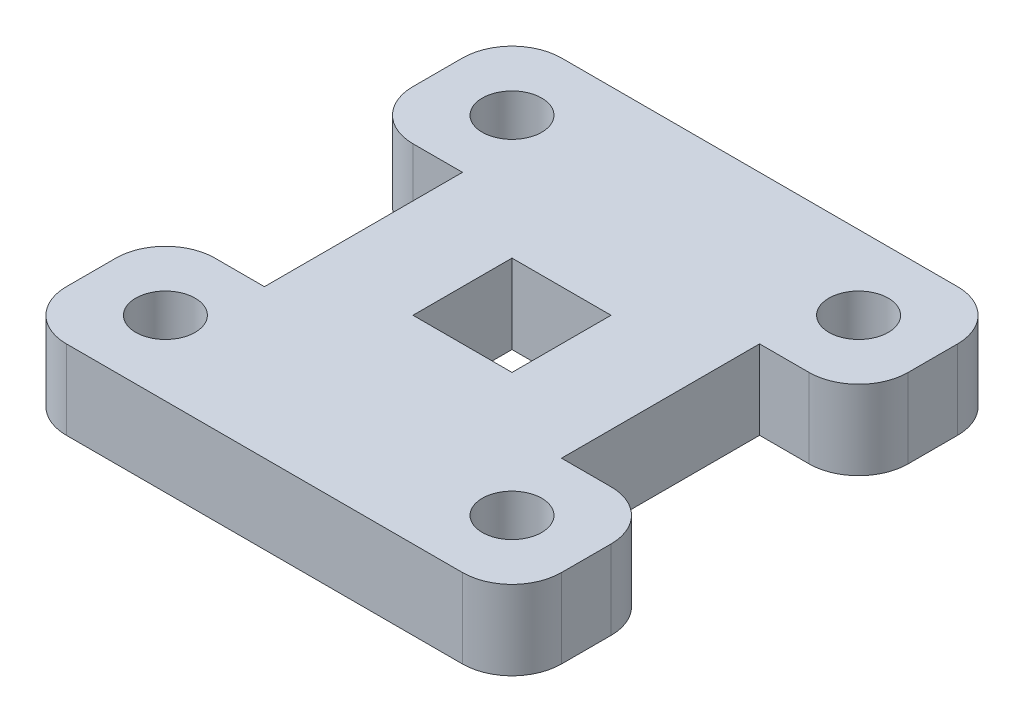
ISO-10303-21;
HEADER;
FILE_DESCRIPTION(('STEP AP214'),'2;1');
FILE_NAME('part.step','',(''),(''),'','','');
FILE_SCHEMA(('AUTOMOTIVE_DESIGN { 1 0 10303 214 1 1 1 1 }'));
ENDSEC;
DATA;
#1=APPLICATION_CONTEXT('core data for automotive mechanical design processes');
#2=APPLICATION_PROTOCOL_DEFINITION('international standard','automotive_design',2000,#1);
#3=PRODUCT_CONTEXT('',#1,'mechanical');
#4=PRODUCT('Part','Part','',(#3));
#5=PRODUCT_RELATED_PRODUCT_CATEGORY('part','',(#4));
#6=PRODUCT_DEFINITION_FORMATION('','',#4);
#7=PRODUCT_DEFINITION_CONTEXT('part definition',#1,'design');
#8=PRODUCT_DEFINITION('design','',#6,#7);
#9=PRODUCT_DEFINITION_SHAPE('','',#8);
#10=(LENGTH_UNIT() NAMED_UNIT(*) SI_UNIT(.MILLI.,.METRE.));
#11=(NAMED_UNIT(*) PLANE_ANGLE_UNIT() SI_UNIT($,.RADIAN.));
#12=(NAMED_UNIT(*) SI_UNIT($,.STERADIAN.) SOLID_ANGLE_UNIT());
#13=UNCERTAINTY_MEASURE_WITH_UNIT(LENGTH_MEASURE(1.E-05),#10,'distance_accuracy_value','');
#14=(GEOMETRIC_REPRESENTATION_CONTEXT(3) GLOBAL_UNCERTAINTY_ASSIGNED_CONTEXT((#13)) GLOBAL_UNIT_ASSIGNED_CONTEXT((#10,
#11,#12)) REPRESENTATION_CONTEXT('',''));
#15=CARTESIAN_POINT('',(0.,0.,0.));
#16=DIRECTION('',(0.,0.,1.));
#17=DIRECTION('',(1.,0.,0.));
#18=AXIS2_PLACEMENT_3D('',#15,#16,#17);
#19=CARTESIAN_POINT('',(-40.,16.,30.));
#20=DIRECTION('',(0.,-1.,0.));
#21=DIRECTION('',(0.,0.,-1.));
#22=AXIS2_PLACEMENT_3D('',#19,#20,#21);
#23=PLANE('',#22);
#24=CARTESIAN_POINT('',(-35.,16.,-35.));
#25=DIRECTION('',(0.,1.,0.));
#26=DIRECTION('',(0.,0.,-1.));
#27=AXIS2_PLACEMENT_3D('',#24,#25,#26);
#28=CIRCLE('',#27,5.99999999999999);
#29=CARTESIAN_POINT('',(-35.,16.,-41.));
#30=VERTEX_POINT('',#29);
#31=EDGE_CURVE('E236',#30,#30,#28,.T.);
#32=ORIENTED_EDGE('',*,*,#31,.F.);
#33=EDGE_LOOP('',(#32));
#34=FACE_BOUND('',#33,.T.);
#35=CARTESIAN_POINT('',(-35.,16.,35.));
#36=DIRECTION('',(0.,1.,0.));
#37=DIRECTION('',(0.,0.,1.));
#38=AXIS2_PLACEMENT_3D('',#35,#36,#37);
#39=CIRCLE('',#38,6.);
#40=CARTESIAN_POINT('',(-35.,16.,41.));
#41=VERTEX_POINT('',#40);
#42=EDGE_CURVE('E242',#41,#41,#39,.T.);
#43=ORIENTED_EDGE('',*,*,#42,.F.);
#44=EDGE_LOOP('',(#43));
#45=FACE_BOUND('',#44,.T.);
#46=CARTESIAN_POINT('',(35.,16.,35.));
#47=DIRECTION('',(0.,1.,0.));
#48=DIRECTION('',(0.,0.,-1.));
#49=AXIS2_PLACEMENT_3D('',#46,#47,#48);
#50=CIRCLE('',#49,5.99999999999999);
#51=CARTESIAN_POINT('',(35.,16.,29.));
#52=VERTEX_POINT('',#51);
#53=EDGE_CURVE('E248',#52,#52,#50,.T.);
#54=ORIENTED_EDGE('',*,*,#53,.F.);
#55=EDGE_LOOP('',(#54));
#56=FACE_BOUND('',#55,.T.);
#57=CARTESIAN_POINT('',(35.,16.,-35.));
#58=DIRECTION('',(0.,1.,0.));
#59=DIRECTION('',(0.,0.,1.));
#60=AXIS2_PLACEMENT_3D('',#57,#58,#59);
#61=CIRCLE('',#60,5.99999999999999);
#62=CARTESIAN_POINT('',(35.,16.,-29.));
#63=VERTEX_POINT('',#62);
#64=EDGE_CURVE('E254',#63,#63,#61,.T.);
#65=ORIENTED_EDGE('',*,*,#64,.F.);
#66=EDGE_LOOP('',(#65));
#67=FACE_BOUND('',#66,.T.);
#68=DIRECTION('',(1.,0.,0.));
#69=VECTOR('',#68,1.);
#70=CARTESIAN_POINT('',(-39.9999999999999,16.,-20.));
#71=LINE('',#70,#69);
#72=CARTESIAN_POINT('',(-40.,16.,-20.));
#73=VERTEX_POINT('',#72);
#74=CARTESIAN_POINT('',(-30.,16.,-20.));
#75=VERTEX_POINT('',#74);
#76=EDGE_CURVE('E260',#73,#75,#71,.T.);
#77=ORIENTED_EDGE('',*,*,#76,.T.);
#78=DIRECTION('',(0.,0.,1.));
#79=VECTOR('',#78,1.);
#80=CARTESIAN_POINT('',(-30.,16.,-20.));
#81=LINE('',#80,#79);
#82=CARTESIAN_POINT('',(-30.,16.,20.));
#83=VERTEX_POINT('',#82);
#84=EDGE_CURVE('E263',#75,#83,#81,.T.);
#85=ORIENTED_EDGE('',*,*,#84,.T.);
#86=DIRECTION('',(-1.,0.,0.));
#87=VECTOR('',#86,1.);
#88=CARTESIAN_POINT('',(-39.9999999999999,16.,20.));
#89=LINE('',#88,#87);
#90=CARTESIAN_POINT('',(-39.9999999999999,16.,20.));
#91=VERTEX_POINT('',#90);
#92=EDGE_CURVE('E266',#83,#91,#89,.T.);
#93=ORIENTED_EDGE('',*,*,#92,.T.);
#94=CARTESIAN_POINT('',(-40.,16.,30.));
#95=DIRECTION('',(0.,1.,0.));
#96=DIRECTION('',(0.,0.,-1.));
#97=AXIS2_PLACEMENT_3D('',#94,#95,#96);
#98=CIRCLE('',#97,10.);
#99=CARTESIAN_POINT('',(-50.,16.,30.0000000000001));
#100=VERTEX_POINT('',#99);
#101=EDGE_CURVE('E268',#91,#100,#98,.T.);
#102=ORIENTED_EDGE('',*,*,#101,.T.);
#103=DIRECTION('',(0.,0.,1.));
#104=VECTOR('',#103,1.);
#105=CARTESIAN_POINT('',(-50.,16.,39.9999999999999));
#106=LINE('',#105,#104);
#107=CARTESIAN_POINT('',(-50.,16.,39.9999999999999));
#108=VERTEX_POINT('',#107);
#109=EDGE_CURVE('E270',#100,#108,#106,.T.);
#110=ORIENTED_EDGE('',*,*,#109,.T.);
#111=CARTESIAN_POINT('',(-40.,16.,40.));
#112=DIRECTION('',(0.,1.,0.));
#113=DIRECTION('',(0.,0.,-1.));
#114=AXIS2_PLACEMENT_3D('',#111,#112,#113);
#115=CIRCLE('',#114,10.);
#116=CARTESIAN_POINT('',(-39.9999999999999,16.,50.));
#117=VERTEX_POINT('',#116);
#118=EDGE_CURVE('E272',#108,#117,#115,.T.);
#119=ORIENTED_EDGE('',*,*,#118,.T.);
#120=DIRECTION('',(1.,0.,0.));
#121=VECTOR('',#120,1.);
#122=CARTESIAN_POINT('',(-39.9999999999999,16.,50.));
#123=LINE('',#122,#121);
#124=CARTESIAN_POINT('',(39.9999999999999,16.,50.));
#125=VERTEX_POINT('',#124);
#126=EDGE_CURVE('E274',#117,#125,#123,.T.);
#127=ORIENTED_EDGE('',*,*,#126,.T.);
#128=CARTESIAN_POINT('',(40.,16.,40.));
#129=DIRECTION('',(0.,1.,0.));
#130=DIRECTION('',(0.,0.,1.));
#131=AXIS2_PLACEMENT_3D('',#128,#129,#130);
#132=CIRCLE('',#131,10.);
#133=CARTESIAN_POINT('',(50.,16.,39.9999999999999));
#134=VERTEX_POINT('',#133);
#135=EDGE_CURVE('E276',#125,#134,#132,.T.);
#136=ORIENTED_EDGE('',*,*,#135,.T.);
#137=DIRECTION('',(0.,0.,-1.));
#138=VECTOR('',#137,1.);
#139=CARTESIAN_POINT('',(50.,16.,39.9999999999999));
#140=LINE('',#139,#138);
#141=CARTESIAN_POINT('',(50.,16.,30.0000000000001));
#142=VERTEX_POINT('',#141);
#143=EDGE_CURVE('E278',#134,#142,#140,.T.);
#144=ORIENTED_EDGE('',*,*,#143,.T.);
#145=CARTESIAN_POINT('',(40.,16.,30.));
#146=DIRECTION('',(0.,1.,0.));
#147=DIRECTION('',(0.,0.,1.));
#148=AXIS2_PLACEMENT_3D('',#145,#146,#147);
#149=CIRCLE('',#148,10.);
#150=CARTESIAN_POINT('',(39.9999999999999,16.,20.));
#151=VERTEX_POINT('',#150);
#152=EDGE_CURVE('E280',#142,#151,#149,.T.);
#153=ORIENTED_EDGE('',*,*,#152,.T.);
#154=DIRECTION('',(-1.,0.,0.));
#155=VECTOR('',#154,1.);
#156=CARTESIAN_POINT('',(39.9999999999999,16.,20.));
#157=LINE('',#156,#155);
#158=CARTESIAN_POINT('',(30.,16.,20.));
#159=VERTEX_POINT('',#158);
#160=EDGE_CURVE('E282',#151,#159,#157,.T.);
#161=ORIENTED_EDGE('',*,*,#160,.T.);
#162=DIRECTION('',(0.,0.,-1.));
#163=VECTOR('',#162,1.);
#164=CARTESIAN_POINT('',(30.,16.,-20.));
#165=LINE('',#164,#163);
#166=CARTESIAN_POINT('',(30.,16.,-20.));
#167=VERTEX_POINT('',#166);
#168=EDGE_CURVE('E284',#159,#167,#165,.T.);
#169=ORIENTED_EDGE('',*,*,#168,.T.);
#170=DIRECTION('',(1.,0.,0.));
#171=VECTOR('',#170,1.);
#172=CARTESIAN_POINT('',(39.9999999999999,16.,-20.));
#173=LINE('',#172,#171);
#174=CARTESIAN_POINT('',(39.9999999999999,16.,-20.));
#175=VERTEX_POINT('',#174);
#176=EDGE_CURVE('E286',#167,#175,#173,.T.);
#177=ORIENTED_EDGE('',*,*,#176,.T.);
#178=CARTESIAN_POINT('',(40.,16.,-30.));
#179=DIRECTION('',(0.,1.,0.));
#180=DIRECTION('',(0.,0.,-1.));
#181=AXIS2_PLACEMENT_3D('',#178,#179,#180);
#182=CIRCLE('',#181,10.);
#183=CARTESIAN_POINT('',(50.,16.,-30.0000000000001));
#184=VERTEX_POINT('',#183);
#185=EDGE_CURVE('E288',#175,#184,#182,.T.);
#186=ORIENTED_EDGE('',*,*,#185,.T.);
#187=DIRECTION('',(0.,0.,-1.));
#188=VECTOR('',#187,1.);
#189=CARTESIAN_POINT('',(50.,16.,-39.9999999999999));
#190=LINE('',#189,#188);
#191=CARTESIAN_POINT('',(50.,16.,-39.9999999999999));
#192=VERTEX_POINT('',#191);
#193=EDGE_CURVE('E290',#184,#192,#190,.T.);
#194=ORIENTED_EDGE('',*,*,#193,.T.);
#195=CARTESIAN_POINT('',(40.,16.,-40.));
#196=DIRECTION('',(0.,1.,0.));
#197=DIRECTION('',(0.,0.,-1.));
#198=AXIS2_PLACEMENT_3D('',#195,#196,#197);
#199=CIRCLE('',#198,10.);
#200=CARTESIAN_POINT('',(39.9999999999999,16.,-50.));
#201=VERTEX_POINT('',#200);
#202=EDGE_CURVE('E292',#192,#201,#199,.T.);
#203=ORIENTED_EDGE('',*,*,#202,.T.);
#204=DIRECTION('',(-1.,0.,0.));
#205=VECTOR('',#204,1.);
#206=CARTESIAN_POINT('',(-39.9999999999999,16.,-50.));
#207=LINE('',#206,#205);
#208=CARTESIAN_POINT('',(-39.9999999999999,16.,-50.));
#209=VERTEX_POINT('',#208);
#210=EDGE_CURVE('E294',#201,#209,#207,.T.);
#211=ORIENTED_EDGE('',*,*,#210,.T.);
#212=CARTESIAN_POINT('',(-40.,16.,-40.));
#213=DIRECTION('',(0.,1.,0.));
#214=DIRECTION('',(0.,0.,1.));
#215=AXIS2_PLACEMENT_3D('',#212,#213,#214);
#216=CIRCLE('',#215,10.);
#217=CARTESIAN_POINT('',(-50.,16.,-39.9999999999999));
#218=VERTEX_POINT('',#217);
#219=EDGE_CURVE('E296',#209,#218,#216,.T.);
#220=ORIENTED_EDGE('',*,*,#219,.T.);
#221=DIRECTION('',(0.,0.,1.));
#222=VECTOR('',#221,1.);
#223=CARTESIAN_POINT('',(-50.,16.,-39.9999999999999));
#224=LINE('',#223,#222);
#225=CARTESIAN_POINT('',(-50.,16.,-30.0000000000001));
#226=VERTEX_POINT('',#225);
#227=EDGE_CURVE('E298',#218,#226,#224,.T.);
#228=ORIENTED_EDGE('',*,*,#227,.T.);
#229=CARTESIAN_POINT('',(-40.,16.,-30.));
#230=DIRECTION('',(0.,1.,0.));
#231=DIRECTION('',(0.,0.,1.));
#232=AXIS2_PLACEMENT_3D('',#229,#230,#231);
#233=CIRCLE('',#232,10.);
#234=EDGE_CURVE('E300',#226,#73,#233,.T.);
#235=ORIENTED_EDGE('',*,*,#234,.T.);
#236=EDGE_LOOP('',(#77,#85,#93,#102,#110,#119,#127,#136,#144,#153,#161,#169,#177,#186,#194,#203,
#211,#220,#228,#235));
#237=FACE_BOUND('',#236,.T.);
#238=DIRECTION('',(0.,0.,-1.));
#239=VECTOR('',#238,1.);
#240=CARTESIAN_POINT('',(10.,16.,10.));
#241=LINE('',#240,#239);
#242=CARTESIAN_POINT('',(10.,16.,10.));
#243=VERTEX_POINT('',#242);
#244=CARTESIAN_POINT('',(10.,16.,-10.));
#245=VERTEX_POINT('',#244);
#246=EDGE_CURVE('E200',#243,#245,#241,.T.);
#247=ORIENTED_EDGE('',*,*,#246,.F.);
#248=DIRECTION('',(1.,0.,0.));
#249=VECTOR('',#248,1.);
#250=CARTESIAN_POINT('',(-10.,16.,10.));
#251=LINE('',#250,#249);
#252=CARTESIAN_POINT('',(-10.,16.,10.));
#253=VERTEX_POINT('',#252);
#254=EDGE_CURVE('E222',#253,#243,#251,.T.);
#255=ORIENTED_EDGE('',*,*,#254,.F.);
#256=DIRECTION('',(0.,0.,1.));
#257=VECTOR('',#256,1.);
#258=CARTESIAN_POINT('',(-10.,16.,10.));
#259=LINE('',#258,#257);
#260=CARTESIAN_POINT('',(-10.,16.,-10.));
#261=VERTEX_POINT('',#260);
#262=EDGE_CURVE('E220',#261,#253,#259,.T.);
#263=ORIENTED_EDGE('',*,*,#262,.F.);
#264=DIRECTION('',(-1.,0.,0.));
#265=VECTOR('',#264,1.);
#266=CARTESIAN_POINT('',(-10.,16.,-10.));
#267=LINE('',#266,#265);
#268=EDGE_CURVE('E208',#245,#261,#267,.T.);
#269=ORIENTED_EDGE('',*,*,#268,.F.);
#270=EDGE_LOOP('',(#247,#255,#263,#269));
#271=FACE_BOUND('',#270,.T.);
#272=ADVANCED_FACE('F39',(#34,#45,#56,#67,#237,#271),#23,.F.);
#273=CARTESIAN_POINT('',(-40.,0.,30.));
#274=DIRECTION('',(0.,-1.,0.));
#275=DIRECTION('',(0.,0.,-1.));
#276=AXIS2_PLACEMENT_3D('',#273,#274,#275);
#277=PLANE('',#276);
#278=CARTESIAN_POINT('',(-35.,0.,35.));
#279=DIRECTION('',(0.,1.,0.));
#280=DIRECTION('',(0.,0.,1.));
#281=AXIS2_PLACEMENT_3D('',#278,#279,#280);
#282=CIRCLE('',#281,6.);
#283=CARTESIAN_POINT('',(-35.,0.,41.));
#284=VERTEX_POINT('',#283);
#285=EDGE_CURVE('E239',#284,#284,#282,.T.);
#286=ORIENTED_EDGE('',*,*,#285,.T.);
#287=EDGE_LOOP('',(#286));
#288=FACE_BOUND('',#287,.T.);
#289=CARTESIAN_POINT('',(35.,0.,-35.));
#290=DIRECTION('',(0.,1.,0.));
#291=DIRECTION('',(0.,0.,1.));
#292=AXIS2_PLACEMENT_3D('',#289,#290,#291);
#293=CIRCLE('',#292,5.99999999999999);
#294=CARTESIAN_POINT('',(35.,0.,-29.));
#295=VERTEX_POINT('',#294);
#296=EDGE_CURVE('E251',#295,#295,#293,.T.);
#297=ORIENTED_EDGE('',*,*,#296,.T.);
#298=EDGE_LOOP('',(#297));
#299=FACE_BOUND('',#298,.T.);
#300=DIRECTION('',(1.,0.,0.));
#301=VECTOR('',#300,1.);
#302=CARTESIAN_POINT('',(-39.9999999999999,0.,-20.));
#303=LINE('',#302,#301);
#304=CARTESIAN_POINT('',(-40.,0.,-20.));
#305=VERTEX_POINT('',#304);
#306=CARTESIAN_POINT('',(-30.,0.,-20.));
#307=VERTEX_POINT('',#306);
#308=EDGE_CURVE('E257',#305,#307,#303,.T.);
#309=ORIENTED_EDGE('',*,*,#308,.F.);
#310=CARTESIAN_POINT('',(-40.,0.,-30.));
#311=DIRECTION('',(0.,1.,0.));
#312=DIRECTION('',(0.,0.,1.));
#313=AXIS2_PLACEMENT_3D('',#310,#311,#312);
#314=CIRCLE('',#313,10.);
#315=CARTESIAN_POINT('',(-50.,0.,-30.0000000000001));
#316=VERTEX_POINT('',#315);
#317=EDGE_CURVE('E264',#316,#305,#314,.T.);
#318=ORIENTED_EDGE('',*,*,#317,.F.);
#319=DIRECTION('',(0.,0.,1.));
#320=VECTOR('',#319,1.);
#321=CARTESIAN_POINT('',(-50.,0.,-39.9999999999999));
#322=LINE('',#321,#320);
#323=CARTESIAN_POINT('',(-50.,0.,-39.9999999999999));
#324=VERTEX_POINT('',#323);
#325=EDGE_CURVE('E339',#324,#316,#322,.T.);
#326=ORIENTED_EDGE('',*,*,#325,.F.);
#327=CARTESIAN_POINT('',(-40.,0.,-40.));
#328=DIRECTION('',(0.,1.,0.));
#329=DIRECTION('',(0.,0.,1.));
#330=AXIS2_PLACEMENT_3D('',#327,#328,#329);
#331=CIRCLE('',#330,10.);
#332=CARTESIAN_POINT('',(-39.9999999999999,0.,-50.));
#333=VERTEX_POINT('',#332);
#334=EDGE_CURVE('E337',#333,#324,#331,.T.);
#335=ORIENTED_EDGE('',*,*,#334,.F.);
#336=DIRECTION('',(-1.,0.,0.));
#337=VECTOR('',#336,1.);
#338=CARTESIAN_POINT('',(-39.9999999999999,0.,-50.));
#339=LINE('',#338,#337);
#340=CARTESIAN_POINT('',(39.9999999999999,0.,-50.));
#341=VERTEX_POINT('',#340);
#342=EDGE_CURVE('E335',#341,#333,#339,.T.);
#343=ORIENTED_EDGE('',*,*,#342,.F.);
#344=CARTESIAN_POINT('',(40.,0.,-40.));
#345=DIRECTION('',(0.,1.,0.));
#346=DIRECTION('',(0.,0.,-1.));
#347=AXIS2_PLACEMENT_3D('',#344,#345,#346);
#348=CIRCLE('',#347,10.);
#349=CARTESIAN_POINT('',(50.,0.,-39.9999999999999));
#350=VERTEX_POINT('',#349);
#351=EDGE_CURVE('E333',#350,#341,#348,.T.);
#352=ORIENTED_EDGE('',*,*,#351,.F.);
#353=DIRECTION('',(0.,0.,-1.));
#354=VECTOR('',#353,1.);
#355=CARTESIAN_POINT('',(50.,0.,-39.9999999999999));
#356=LINE('',#355,#354);
#357=CARTESIAN_POINT('',(50.,0.,-30.0000000000001));
#358=VERTEX_POINT('',#357);
#359=EDGE_CURVE('E331',#358,#350,#356,.T.);
#360=ORIENTED_EDGE('',*,*,#359,.F.);
#361=CARTESIAN_POINT('',(40.,0.,-30.));
#362=DIRECTION('',(0.,1.,0.));
#363=DIRECTION('',(0.,0.,-1.));
#364=AXIS2_PLACEMENT_3D('',#361,#362,#363);
#365=CIRCLE('',#364,10.);
#366=CARTESIAN_POINT('',(39.9999999999999,0.,-20.));
#367=VERTEX_POINT('',#366);
#368=EDGE_CURVE('E329',#367,#358,#365,.T.);
#369=ORIENTED_EDGE('',*,*,#368,.F.);
#370=DIRECTION('',(1.,0.,0.));
#371=VECTOR('',#370,1.);
#372=CARTESIAN_POINT('',(39.9999999999999,0.,-20.));
#373=LINE('',#372,#371);
#374=CARTESIAN_POINT('',(30.,0.,-20.));
#375=VERTEX_POINT('',#374);
#376=EDGE_CURVE('E327',#375,#367,#373,.T.);
#377=ORIENTED_EDGE('',*,*,#376,.F.);
#378=DIRECTION('',(0.,0.,-1.));
#379=VECTOR('',#378,1.);
#380=CARTESIAN_POINT('',(30.,0.,-20.));
#381=LINE('',#380,#379);
#382=CARTESIAN_POINT('',(30.,0.,20.));
#383=VERTEX_POINT('',#382);
#384=EDGE_CURVE('E325',#383,#375,#381,.T.);
#385=ORIENTED_EDGE('',*,*,#384,.F.);
#386=DIRECTION('',(-1.,0.,0.));
#387=VECTOR('',#386,1.);
#388=CARTESIAN_POINT('',(39.9999999999999,0.,20.));
#389=LINE('',#388,#387);
#390=CARTESIAN_POINT('',(39.9999999999999,0.,20.));
#391=VERTEX_POINT('',#390);
#392=EDGE_CURVE('E323',#391,#383,#389,.T.);
#393=ORIENTED_EDGE('',*,*,#392,.F.);
#394=CARTESIAN_POINT('',(40.,0.,30.));
#395=DIRECTION('',(0.,1.,0.));
#396=DIRECTION('',(0.,0.,1.));
#397=AXIS2_PLACEMENT_3D('',#394,#395,#396);
#398=CIRCLE('',#397,10.);
#399=CARTESIAN_POINT('',(50.,0.,30.0000000000001));
#400=VERTEX_POINT('',#399);
#401=EDGE_CURVE('E321',#400,#391,#398,.T.);
#402=ORIENTED_EDGE('',*,*,#401,.F.);
#403=DIRECTION('',(0.,0.,-1.));
#404=VECTOR('',#403,1.);
#405=CARTESIAN_POINT('',(50.,0.,39.9999999999999));
#406=LINE('',#405,#404);
#407=CARTESIAN_POINT('',(50.,0.,39.9999999999999));
#408=VERTEX_POINT('',#407);
#409=EDGE_CURVE('E319',#408,#400,#406,.T.);
#410=ORIENTED_EDGE('',*,*,#409,.F.);
#411=CARTESIAN_POINT('',(40.,0.,40.));
#412=DIRECTION('',(0.,1.,0.));
#413=DIRECTION('',(0.,0.,1.));
#414=AXIS2_PLACEMENT_3D('',#411,#412,#413);
#415=CIRCLE('',#414,10.);
#416=CARTESIAN_POINT('',(39.9999999999999,0.,50.));
#417=VERTEX_POINT('',#416);
#418=EDGE_CURVE('E317',#417,#408,#415,.T.);
#419=ORIENTED_EDGE('',*,*,#418,.F.);
#420=DIRECTION('',(1.,0.,0.));
#421=VECTOR('',#420,1.);
#422=CARTESIAN_POINT('',(-39.9999999999999,0.,50.));
#423=LINE('',#422,#421);
#424=CARTESIAN_POINT('',(-39.9999999999999,0.,50.));
#425=VERTEX_POINT('',#424);
#426=EDGE_CURVE('E315',#425,#417,#423,.T.);
#427=ORIENTED_EDGE('',*,*,#426,.F.);
#428=CARTESIAN_POINT('',(-40.,0.,40.));
#429=DIRECTION('',(0.,1.,0.));
#430=DIRECTION('',(0.,0.,-1.));
#431=AXIS2_PLACEMENT_3D('',#428,#429,#430);
#432=CIRCLE('',#431,10.);
#433=CARTESIAN_POINT('',(-50.,0.,39.9999999999999));
#434=VERTEX_POINT('',#433);
#435=EDGE_CURVE('E313',#434,#425,#432,.T.);
#436=ORIENTED_EDGE('',*,*,#435,.F.);
#437=DIRECTION('',(0.,0.,1.));
#438=VECTOR('',#437,1.);
#439=CARTESIAN_POINT('',(-50.,0.,39.9999999999999));
#440=LINE('',#439,#438);
#441=CARTESIAN_POINT('',(-50.,0.,30.0000000000001));
#442=VERTEX_POINT('',#441);
#443=EDGE_CURVE('E311',#442,#434,#440,.T.);
#444=ORIENTED_EDGE('',*,*,#443,.F.);
#445=CARTESIAN_POINT('',(-40.,0.,30.));
#446=DIRECTION('',(0.,1.,0.));
#447=DIRECTION('',(0.,0.,-1.));
#448=AXIS2_PLACEMENT_3D('',#445,#446,#447);
#449=CIRCLE('',#448,10.);
#450=CARTESIAN_POINT('',(-39.9999999999999,0.,20.));
#451=VERTEX_POINT('',#450);
#452=EDGE_CURVE('E309',#451,#442,#449,.T.);
#453=ORIENTED_EDGE('',*,*,#452,.F.);
#454=DIRECTION('',(-1.,0.,0.));
#455=VECTOR('',#454,1.);
#456=CARTESIAN_POINT('',(-39.9999999999999,0.,20.));
#457=LINE('',#456,#455);
#458=CARTESIAN_POINT('',(-30.,0.,20.));
#459=VERTEX_POINT('',#458);
#460=EDGE_CURVE('E307',#459,#451,#457,.T.);
#461=ORIENTED_EDGE('',*,*,#460,.F.);
#462=DIRECTION('',(0.,0.,1.));
#463=VECTOR('',#462,1.);
#464=CARTESIAN_POINT('',(-30.,0.,-20.));
#465=LINE('',#464,#463);
#466=EDGE_CURVE('E305',#307,#459,#465,.T.);
#467=ORIENTED_EDGE('',*,*,#466,.F.);
#468=EDGE_LOOP('',(#309,#318,#326,#335,#343,#352,#360,#369,#377,#385,#393,#402,#410,#419,#427,
#436,#444,#453,#461,#467));
#469=FACE_BOUND('',#468,.T.);
#470=CARTESIAN_POINT('',(35.,0.,35.));
#471=DIRECTION('',(0.,1.,0.));
#472=DIRECTION('',(0.,0.,-1.));
#473=AXIS2_PLACEMENT_3D('',#470,#471,#472);
#474=CIRCLE('',#473,5.99999999999999);
#475=CARTESIAN_POINT('',(35.,0.,29.));
#476=VERTEX_POINT('',#475);
#477=EDGE_CURVE('E245',#476,#476,#474,.T.);
#478=ORIENTED_EDGE('',*,*,#477,.T.);
#479=EDGE_LOOP('',(#478));
#480=FACE_BOUND('',#479,.T.);
#481=CARTESIAN_POINT('',(-35.,0.,-35.));
#482=DIRECTION('',(0.,1.,0.));
#483=DIRECTION('',(0.,0.,-1.));
#484=AXIS2_PLACEMENT_3D('',#481,#482,#483);
#485=CIRCLE('',#484,5.99999999999999);
#486=CARTESIAN_POINT('',(-35.,0.,-41.));
#487=VERTEX_POINT('',#486);
#488=EDGE_CURVE('E216',#487,#487,#485,.T.);
#489=ORIENTED_EDGE('',*,*,#488,.T.);
#490=EDGE_LOOP('',(#489));
#491=FACE_BOUND('',#490,.T.);
#492=DIRECTION('',(1.,0.,0.));
#493=VECTOR('',#492,1.);
#494=CARTESIAN_POINT('',(-10.,0.,10.));
#495=LINE('',#494,#493);
#496=CARTESIAN_POINT('',(-10.,0.,10.));
#497=VERTEX_POINT('',#496);
#498=CARTESIAN_POINT('',(9.99999999999999,0.,10.));
#499=VERTEX_POINT('',#498);
#500=EDGE_CURVE('E209',#497,#499,#495,.T.);
#501=ORIENTED_EDGE('',*,*,#500,.T.);
#502=DIRECTION('',(0.,0.,-1.));
#503=VECTOR('',#502,1.);
#504=CARTESIAN_POINT('',(10.,0.,10.));
#505=LINE('',#504,#503);
#506=CARTESIAN_POINT('',(10.,0.,-10.));
#507=VERTEX_POINT('',#506);
#508=EDGE_CURVE('E62',#499,#507,#505,.T.);
#509=ORIENTED_EDGE('',*,*,#508,.T.);
#510=DIRECTION('',(-1.,0.,0.));
#511=VECTOR('',#510,1.);
#512=CARTESIAN_POINT('',(-10.,0.,-10.));
#513=LINE('',#512,#511);
#514=CARTESIAN_POINT('',(-10.,0.,-10.));
#515=VERTEX_POINT('',#514);
#516=EDGE_CURVE('E215',#507,#515,#513,.T.);
#517=ORIENTED_EDGE('',*,*,#516,.T.);
#518=DIRECTION('',(0.,0.,1.));
#519=VECTOR('',#518,1.);
#520=CARTESIAN_POINT('',(-10.,0.,10.));
#521=LINE('',#520,#519);
#522=EDGE_CURVE('E228',#515,#497,#521,.T.);
#523=ORIENTED_EDGE('',*,*,#522,.T.);
#524=EDGE_LOOP('',(#501,#509,#517,#523));
#525=FACE_BOUND('',#524,.T.);
#526=ADVANCED_FACE('F405',(#288,#299,#469,#480,#491,#525),#277,.T.);
#527=CARTESIAN_POINT('',(-39.9999999999999,16.,-20.));
#528=DIRECTION('',(0.,0.,-1.));
#529=DIRECTION('',(-1.,0.,0.));
#530=AXIS2_PLACEMENT_3D('',#527,#528,#529);
#531=PLANE('',#530);
#532=ORIENTED_EDGE('',*,*,#308,.T.);
#533=DIRECTION('',(0.,-1.,0.));
#534=VECTOR('',#533,1.);
#535=CARTESIAN_POINT('',(-30.,16.,-20.));
#536=LINE('',#535,#534);
#537=EDGE_CURVE('E11',#75,#307,#536,.T.);
#538=ORIENTED_EDGE('',*,*,#537,.F.);
#539=ORIENTED_EDGE('',*,*,#76,.F.);
#540=DIRECTION('',(0.,-1.,0.));
#541=VECTOR('',#540,1.);
#542=CARTESIAN_POINT('',(-40.,16.,-20.));
#543=LINE('',#542,#541);
#544=EDGE_CURVE('E302',#73,#305,#543,.T.);
#545=ORIENTED_EDGE('',*,*,#544,.T.);
#546=EDGE_LOOP('',(#532,#538,#539,#545));
#547=FACE_BOUND('',#546,.T.);
#548=ADVANCED_FACE('F41',(#547),#531,.F.);
#549=CARTESIAN_POINT('',(-30.,16.,-20.));
#550=DIRECTION('',(1.,0.,0.));
#551=DIRECTION('',(0.,0.,-1.));
#552=AXIS2_PLACEMENT_3D('',#549,#550,#551);
#553=PLANE('',#552);
#554=ORIENTED_EDGE('',*,*,#466,.T.);
#555=DIRECTION('',(0.,-1.,0.));
#556=VECTOR('',#555,1.);
#557=CARTESIAN_POINT('',(-30.,16.,20.));
#558=LINE('',#557,#556);
#559=EDGE_CURVE('E47',#83,#459,#558,.T.);
#560=ORIENTED_EDGE('',*,*,#559,.F.);
#561=ORIENTED_EDGE('',*,*,#84,.F.);
#562=ORIENTED_EDGE('',*,*,#537,.T.);
#563=EDGE_LOOP('',(#554,#560,#561,#562));
#564=FACE_BOUND('',#563,.T.);
#565=ADVANCED_FACE('F422',(#564),#553,.F.);
#566=CARTESIAN_POINT('',(-39.9999999999999,16.,20.));
#567=DIRECTION('',(0.,0.,1.));
#568=DIRECTION('',(1.,0.,0.));
#569=AXIS2_PLACEMENT_3D('',#566,#567,#568);
#570=PLANE('',#569);
#571=ORIENTED_EDGE('',*,*,#460,.T.);
#572=DIRECTION('',(0.,-1.,0.));
#573=VECTOR('',#572,1.);
#574=CARTESIAN_POINT('',(-39.9999999999999,16.,20.));
#575=LINE('',#574,#573);
#576=EDGE_CURVE('E392',#91,#451,#575,.T.);
#577=ORIENTED_EDGE('',*,*,#576,.F.);
#578=ORIENTED_EDGE('',*,*,#92,.F.);
#579=ORIENTED_EDGE('',*,*,#559,.T.);
#580=EDGE_LOOP('',(#571,#577,#578,#579));
#581=FACE_BOUND('',#580,.T.);
#582=ADVANCED_FACE('F399',(#581),#570,.F.);
#583=CARTESIAN_POINT('',(-40.,16.,30.));
#584=DIRECTION('',(0.,-1.,0.));
#585=DIRECTION('',(0.,0.,-1.));
#586=AXIS2_PLACEMENT_3D('',#583,#584,#585);
#587=CYLINDRICAL_SURFACE('',#586,10.);
#588=ORIENTED_EDGE('',*,*,#452,.T.);
#589=DIRECTION('',(0.,-1.,0.));
#590=VECTOR('',#589,1.);
#591=CARTESIAN_POINT('',(-50.,16.,30.0000000000001));
#592=LINE('',#591,#590);
#593=EDGE_CURVE('E389',#100,#442,#592,.T.);
#594=ORIENTED_EDGE('',*,*,#593,.F.);
#595=ORIENTED_EDGE('',*,*,#101,.F.);
#596=ORIENTED_EDGE('',*,*,#576,.T.);
#597=EDGE_LOOP('',(#588,#594,#595,#596));
#598=FACE_BOUND('',#597,.T.);
#599=ADVANCED_FACE('F411',(#598),#587,.T.);
#600=CARTESIAN_POINT('',(-50.,16.,39.9999999999999));
#601=DIRECTION('',(1.,0.,0.));
#602=DIRECTION('',(0.,0.,-1.));
#603=AXIS2_PLACEMENT_3D('',#600,#601,#602);
#604=PLANE('',#603);
#605=ORIENTED_EDGE('',*,*,#443,.T.);
#606=DIRECTION('',(0.,-1.,0.));
#607=VECTOR('',#606,1.);
#608=CARTESIAN_POINT('',(-50.,16.,39.9999999999999));
#609=LINE('',#608,#607);
#610=EDGE_CURVE('E386',#108,#434,#609,.T.);
#611=ORIENTED_EDGE('',*,*,#610,.F.);
#612=ORIENTED_EDGE('',*,*,#109,.F.);
#613=ORIENTED_EDGE('',*,*,#593,.T.);
#614=EDGE_LOOP('',(#605,#611,#612,#613));
#615=FACE_BOUND('',#614,.T.);
#616=ADVANCED_FACE('F415',(#615),#604,.F.);
#617=CARTESIAN_POINT('',(-40.,16.,40.));
#618=DIRECTION('',(0.,-1.,0.));
#619=DIRECTION('',(0.,0.,-1.));
#620=AXIS2_PLACEMENT_3D('',#617,#618,#619);
#621=CYLINDRICAL_SURFACE('',#620,10.);
#622=ORIENTED_EDGE('',*,*,#435,.T.);
#623=DIRECTION('',(0.,-1.,0.));
#624=VECTOR('',#623,1.);
#625=CARTESIAN_POINT('',(-39.9999999999999,16.,50.));
#626=LINE('',#625,#624);
#627=EDGE_CURVE('E383',#117,#425,#626,.T.);
#628=ORIENTED_EDGE('',*,*,#627,.F.);
#629=ORIENTED_EDGE('',*,*,#118,.F.);
#630=ORIENTED_EDGE('',*,*,#610,.T.);
#631=EDGE_LOOP('',(#622,#628,#629,#630));
#632=FACE_BOUND('',#631,.T.);
#633=ADVANCED_FACE('F495',(#632),#621,.T.);
#634=CARTESIAN_POINT('',(-39.9999999999999,16.,50.));
#635=DIRECTION('',(0.,0.,-1.));
#636=DIRECTION('',(-1.,0.,0.));
#637=AXIS2_PLACEMENT_3D('',#634,#635,#636);
#638=PLANE('',#637);
#639=ORIENTED_EDGE('',*,*,#426,.T.);
#640=DIRECTION('',(0.,-1.,0.));
#641=VECTOR('',#640,1.);
#642=CARTESIAN_POINT('',(39.9999999999999,16.,50.));
#643=LINE('',#642,#641);
#644=EDGE_CURVE('E380',#125,#417,#643,.T.);
#645=ORIENTED_EDGE('',*,*,#644,.F.);
#646=ORIENTED_EDGE('',*,*,#126,.F.);
#647=ORIENTED_EDGE('',*,*,#627,.T.);
#648=EDGE_LOOP('',(#639,#645,#646,#647));
#649=FACE_BOUND('',#648,.T.);
#650=ADVANCED_FACE('F493',(#649),#638,.F.);
#651=CARTESIAN_POINT('',(40.,16.,40.));
#652=DIRECTION('',(0.,-1.,0.));
#653=DIRECTION('',(0.,0.,-1.));
#654=AXIS2_PLACEMENT_3D('',#651,#652,#653);
#655=CYLINDRICAL_SURFACE('',#654,10.);
#656=ORIENTED_EDGE('',*,*,#418,.T.);
#657=DIRECTION('',(0.,-1.,0.));
#658=VECTOR('',#657,1.);
#659=CARTESIAN_POINT('',(50.,16.,39.9999999999999));
#660=LINE('',#659,#658);
#661=EDGE_CURVE('E377',#134,#408,#660,.T.);
#662=ORIENTED_EDGE('',*,*,#661,.F.);
#663=ORIENTED_EDGE('',*,*,#135,.F.);
#664=ORIENTED_EDGE('',*,*,#644,.T.);
#665=EDGE_LOOP('',(#656,#662,#663,#664));
#666=FACE_BOUND('',#665,.T.);
#667=ADVANCED_FACE('F488',(#666),#655,.T.);
#668=CARTESIAN_POINT('',(50.,16.,39.9999999999999));
#669=DIRECTION('',(-1.,0.,0.));
#670=DIRECTION('',(0.,0.,1.));
#671=AXIS2_PLACEMENT_3D('',#668,#669,#670);
#672=PLANE('',#671);
#673=ORIENTED_EDGE('',*,*,#409,.T.);
#674=DIRECTION('',(0.,-1.,0.));
#675=VECTOR('',#674,1.);
#676=CARTESIAN_POINT('',(50.,16.,30.0000000000001));
#677=LINE('',#676,#675);
#678=EDGE_CURVE('E374',#142,#400,#677,.T.);
#679=ORIENTED_EDGE('',*,*,#678,.F.);
#680=ORIENTED_EDGE('',*,*,#143,.F.);
#681=ORIENTED_EDGE('',*,*,#661,.T.);
#682=EDGE_LOOP('',(#673,#679,#680,#681));
#683=FACE_BOUND('',#682,.T.);
#684=ADVANCED_FACE('F483',(#683),#672,.F.);
#685=CARTESIAN_POINT('',(40.,16.,30.));
#686=DIRECTION('',(0.,-1.,0.));
#687=DIRECTION('',(0.,0.,-1.));
#688=AXIS2_PLACEMENT_3D('',#685,#686,#687);
#689=CYLINDRICAL_SURFACE('',#688,10.);
#690=ORIENTED_EDGE('',*,*,#401,.T.);
#691=DIRECTION('',(0.,-1.,0.));
#692=VECTOR('',#691,1.);
#693=CARTESIAN_POINT('',(39.9999999999999,16.,20.));
#694=LINE('',#693,#692);
#695=EDGE_CURVE('E371',#151,#391,#694,.T.);
#696=ORIENTED_EDGE('',*,*,#695,.F.);
#697=ORIENTED_EDGE('',*,*,#152,.F.);
#698=ORIENTED_EDGE('',*,*,#678,.T.);
#699=EDGE_LOOP('',(#690,#696,#697,#698));
#700=FACE_BOUND('',#699,.T.);
#701=ADVANCED_FACE('F479',(#700),#689,.T.);
#702=CARTESIAN_POINT('',(39.9999999999999,16.,20.));
#703=DIRECTION('',(0.,0.,1.));
#704=DIRECTION('',(1.,0.,0.));
#705=AXIS2_PLACEMENT_3D('',#702,#703,#704);
#706=PLANE('',#705);
#707=ORIENTED_EDGE('',*,*,#392,.T.);
#708=DIRECTION('',(0.,-1.,0.));
#709=VECTOR('',#708,1.);
#710=CARTESIAN_POINT('',(30.,16.,20.));
#711=LINE('',#710,#709);
#712=EDGE_CURVE('E368',#159,#383,#711,.T.);
#713=ORIENTED_EDGE('',*,*,#712,.F.);
#714=ORIENTED_EDGE('',*,*,#160,.F.);
#715=ORIENTED_EDGE('',*,*,#695,.T.);
#716=EDGE_LOOP('',(#707,#713,#714,#715));
#717=FACE_BOUND('',#716,.T.);
#718=ADVANCED_FACE('F474',(#717),#706,.F.);
#719=CARTESIAN_POINT('',(30.,16.,-20.));
#720=DIRECTION('',(-1.,0.,0.));
#721=DIRECTION('',(0.,0.,1.));
#722=AXIS2_PLACEMENT_3D('',#719,#720,#721);
#723=PLANE('',#722);
#724=ORIENTED_EDGE('',*,*,#384,.T.);
#725=DIRECTION('',(0.,-1.,0.));
#726=VECTOR('',#725,1.);
#727=CARTESIAN_POINT('',(30.,16.,-20.));
#728=LINE('',#727,#726);
#729=EDGE_CURVE('E365',#167,#375,#728,.T.);
#730=ORIENTED_EDGE('',*,*,#729,.F.);
#731=ORIENTED_EDGE('',*,*,#168,.F.);
#732=ORIENTED_EDGE('',*,*,#712,.T.);
#733=EDGE_LOOP('',(#724,#730,#731,#732));
#734=FACE_BOUND('',#733,.T.);
#735=ADVANCED_FACE('F468',(#734),#723,.F.);
#736=CARTESIAN_POINT('',(39.9999999999999,16.,-20.));
#737=DIRECTION('',(0.,0.,-1.));
#738=DIRECTION('',(-1.,0.,0.));
#739=AXIS2_PLACEMENT_3D('',#736,#737,#738);
#740=PLANE('',#739);
#741=ORIENTED_EDGE('',*,*,#376,.T.);
#742=DIRECTION('',(0.,-1.,0.));
#743=VECTOR('',#742,1.);
#744=CARTESIAN_POINT('',(39.9999999999999,16.,-20.));
#745=LINE('',#744,#743);
#746=EDGE_CURVE('E362',#175,#367,#745,.T.);
#747=ORIENTED_EDGE('',*,*,#746,.F.);
#748=ORIENTED_EDGE('',*,*,#176,.F.);
#749=ORIENTED_EDGE('',*,*,#729,.T.);
#750=EDGE_LOOP('',(#741,#747,#748,#749));
#751=FACE_BOUND('',#750,.T.);
#752=ADVANCED_FACE('F464',(#751),#740,.F.);
#753=CARTESIAN_POINT('',(40.,16.,-30.));
#754=DIRECTION('',(0.,-1.,0.));
#755=DIRECTION('',(0.,0.,-1.));
#756=AXIS2_PLACEMENT_3D('',#753,#754,#755);
#757=CYLINDRICAL_SURFACE('',#756,10.);
#758=ORIENTED_EDGE('',*,*,#368,.T.);
#759=DIRECTION('',(0.,-1.,0.));
#760=VECTOR('',#759,1.);
#761=CARTESIAN_POINT('',(50.,16.,-30.0000000000001));
#762=LINE('',#761,#760);
#763=EDGE_CURVE('E359',#184,#358,#762,.T.);
#764=ORIENTED_EDGE('',*,*,#763,.F.);
#765=ORIENTED_EDGE('',*,*,#185,.F.);
#766=ORIENTED_EDGE('',*,*,#746,.T.);
#767=EDGE_LOOP('',(#758,#764,#765,#766));
#768=FACE_BOUND('',#767,.T.);
#769=ADVANCED_FACE('F459',(#768),#757,.T.);
#770=CARTESIAN_POINT('',(50.,16.,-39.9999999999999));
#771=DIRECTION('',(-1.,0.,0.));
#772=DIRECTION('',(0.,0.,1.));
#773=AXIS2_PLACEMENT_3D('',#770,#771,#772);
#774=PLANE('',#773);
#775=ORIENTED_EDGE('',*,*,#359,.T.);
#776=DIRECTION('',(0.,-1.,0.));
#777=VECTOR('',#776,1.);
#778=CARTESIAN_POINT('',(50.,16.,-39.9999999999999));
#779=LINE('',#778,#777);
#780=EDGE_CURVE('E356',#192,#350,#779,.T.);
#781=ORIENTED_EDGE('',*,*,#780,.F.);
#782=ORIENTED_EDGE('',*,*,#193,.F.);
#783=ORIENTED_EDGE('',*,*,#763,.T.);
#784=EDGE_LOOP('',(#775,#781,#782,#783));
#785=FACE_BOUND('',#784,.T.);
#786=ADVANCED_FACE('F453',(#785),#774,.F.);
#787=CARTESIAN_POINT('',(40.,16.,-40.));
#788=DIRECTION('',(0.,-1.,0.));
#789=DIRECTION('',(0.,0.,-1.));
#790=AXIS2_PLACEMENT_3D('',#787,#788,#789);
#791=CYLINDRICAL_SURFACE('',#790,10.);
#792=ORIENTED_EDGE('',*,*,#351,.T.);
#793=DIRECTION('',(0.,-1.,0.));
#794=VECTOR('',#793,1.);
#795=CARTESIAN_POINT('',(39.9999999999999,16.,-50.));
#796=LINE('',#795,#794);
#797=EDGE_CURVE('E353',#201,#341,#796,.T.);
#798=ORIENTED_EDGE('',*,*,#797,.F.);
#799=ORIENTED_EDGE('',*,*,#202,.F.);
#800=ORIENTED_EDGE('',*,*,#780,.T.);
#801=EDGE_LOOP('',(#792,#798,#799,#800));
#802=FACE_BOUND('',#801,.T.);
#803=ADVANCED_FACE('F449',(#802),#791,.T.);
#804=CARTESIAN_POINT('',(-39.9999999999999,16.,-50.));
#805=DIRECTION('',(0.,0.,1.));
#806=DIRECTION('',(1.,0.,0.));
#807=AXIS2_PLACEMENT_3D('',#804,#805,#806);
#808=PLANE('',#807);
#809=ORIENTED_EDGE('',*,*,#342,.T.);
#810=DIRECTION('',(0.,-1.,0.));
#811=VECTOR('',#810,1.);
#812=CARTESIAN_POINT('',(-39.9999999999999,16.,-50.));
#813=LINE('',#812,#811);
#814=EDGE_CURVE('E350',#209,#333,#813,.T.);
#815=ORIENTED_EDGE('',*,*,#814,.F.);
#816=ORIENTED_EDGE('',*,*,#210,.F.);
#817=ORIENTED_EDGE('',*,*,#797,.T.);
#818=EDGE_LOOP('',(#809,#815,#816,#817));
#819=FACE_BOUND('',#818,.T.);
#820=ADVANCED_FACE('F444',(#819),#808,.F.);
#821=CARTESIAN_POINT('',(-40.,16.,-40.));
#822=DIRECTION('',(0.,-1.,0.));
#823=DIRECTION('',(0.,0.,-1.));
#824=AXIS2_PLACEMENT_3D('',#821,#822,#823);
#825=CYLINDRICAL_SURFACE('',#824,10.);
#826=ORIENTED_EDGE('',*,*,#334,.T.);
#827=DIRECTION('',(0.,-1.,0.));
#828=VECTOR('',#827,1.);
#829=CARTESIAN_POINT('',(-50.,16.,-39.9999999999999));
#830=LINE('',#829,#828);
#831=EDGE_CURVE('E347',#218,#324,#830,.T.);
#832=ORIENTED_EDGE('',*,*,#831,.F.);
#833=ORIENTED_EDGE('',*,*,#219,.F.);
#834=ORIENTED_EDGE('',*,*,#814,.T.);
#835=EDGE_LOOP('',(#826,#832,#833,#834));
#836=FACE_BOUND('',#835,.T.);
#837=ADVANCED_FACE('F438',(#836),#825,.T.);
#838=CARTESIAN_POINT('',(-50.,16.,-39.9999999999999));
#839=DIRECTION('',(1.,0.,0.));
#840=DIRECTION('',(0.,0.,-1.));
#841=AXIS2_PLACEMENT_3D('',#838,#839,#840);
#842=PLANE('',#841);
#843=ORIENTED_EDGE('',*,*,#325,.T.);
#844=DIRECTION('',(0.,-1.,0.));
#845=VECTOR('',#844,1.);
#846=CARTESIAN_POINT('',(-50.,16.,-30.0000000000001));
#847=LINE('',#846,#845);
#848=EDGE_CURVE('E344',#226,#316,#847,.T.);
#849=ORIENTED_EDGE('',*,*,#848,.F.);
#850=ORIENTED_EDGE('',*,*,#227,.F.);
#851=ORIENTED_EDGE('',*,*,#831,.T.);
#852=EDGE_LOOP('',(#843,#849,#850,#851));
#853=FACE_BOUND('',#852,.T.);
#854=ADVANCED_FACE('F434',(#853),#842,.F.);
#855=CARTESIAN_POINT('',(-40.,16.,-30.));
#856=DIRECTION('',(0.,-1.,0.));
#857=DIRECTION('',(0.,0.,-1.));
#858=AXIS2_PLACEMENT_3D('',#855,#856,#857);
#859=CYLINDRICAL_SURFACE('',#858,10.);
#860=ORIENTED_EDGE('',*,*,#317,.T.);
#861=ORIENTED_EDGE('',*,*,#544,.F.);
#862=ORIENTED_EDGE('',*,*,#234,.F.);
#863=ORIENTED_EDGE('',*,*,#848,.T.);
#864=EDGE_LOOP('',(#860,#861,#862,#863));
#865=FACE_BOUND('',#864,.T.);
#866=ADVANCED_FACE('F429',(#865),#859,.T.);
#867=CARTESIAN_POINT('',(35.,16.,-35.));
#868=DIRECTION('',(0.,-1.,0.));
#869=DIRECTION('',(0.,0.,-1.));
#870=AXIS2_PLACEMENT_3D('',#867,#868,#869);
#871=CYLINDRICAL_SURFACE('',#870,5.99999999999999);
#872=ORIENTED_EDGE('',*,*,#64,.T.);
#873=EDGE_LOOP('',(#872));
#874=FACE_BOUND('',#873,.T.);
#875=ORIENTED_EDGE('',*,*,#296,.F.);
#876=EDGE_LOOP('',(#875));
#877=FACE_BOUND('',#876,.T.);
#878=ADVANCED_FACE('F515',(#874,#877),#871,.F.);
#879=CARTESIAN_POINT('',(35.,16.,35.));
#880=DIRECTION('',(0.,-1.,0.));
#881=DIRECTION('',(0.,0.,-1.));
#882=AXIS2_PLACEMENT_3D('',#879,#880,#881);
#883=CYLINDRICAL_SURFACE('',#882,5.99999999999999);
#884=ORIENTED_EDGE('',*,*,#53,.T.);
#885=EDGE_LOOP('',(#884));
#886=FACE_BOUND('',#885,.T.);
#887=ORIENTED_EDGE('',*,*,#477,.F.);
#888=EDGE_LOOP('',(#887));
#889=FACE_BOUND('',#888,.T.);
#890=ADVANCED_FACE('F601',(#886,#889),#883,.F.);
#891=CARTESIAN_POINT('',(-35.,16.,35.));
#892=DIRECTION('',(0.,-1.,0.));
#893=DIRECTION('',(0.,0.,-1.));
#894=AXIS2_PLACEMENT_3D('',#891,#892,#893);
#895=CYLINDRICAL_SURFACE('',#894,6.);
#896=ORIENTED_EDGE('',*,*,#42,.T.);
#897=EDGE_LOOP('',(#896));
#898=FACE_BOUND('',#897,.T.);
#899=ORIENTED_EDGE('',*,*,#285,.F.);
#900=EDGE_LOOP('',(#899));
#901=FACE_BOUND('',#900,.T.);
#902=ADVANCED_FACE('F608',(#898,#901),#895,.F.);
#903=CARTESIAN_POINT('',(-35.,16.,-35.));
#904=DIRECTION('',(0.,-1.,0.));
#905=DIRECTION('',(0.,0.,-1.));
#906=AXIS2_PLACEMENT_3D('',#903,#904,#905);
#907=CYLINDRICAL_SURFACE('',#906,5.99999999999999);
#908=ORIENTED_EDGE('',*,*,#31,.T.);
#909=EDGE_LOOP('',(#908));
#910=FACE_BOUND('',#909,.T.);
#911=ORIENTED_EDGE('',*,*,#488,.F.);
#912=EDGE_LOOP('',(#911));
#913=FACE_BOUND('',#912,.T.);
#914=ADVANCED_FACE('F615',(#910,#913),#907,.F.);
#915=CARTESIAN_POINT('',(10.,16.,10.));
#916=DIRECTION('',(-1.,0.,0.));
#917=DIRECTION('',(0.,0.,1.));
#918=AXIS2_PLACEMENT_3D('',#915,#916,#917);
#919=PLANE('',#918);
#920=ORIENTED_EDGE('',*,*,#508,.F.);
#921=DIRECTION('',(0.,-1.,0.));
#922=VECTOR('',#921,1.);
#923=CARTESIAN_POINT('',(10.,16.,10.));
#924=LINE('',#923,#922);
#925=EDGE_CURVE('E204',#243,#499,#924,.T.);
#926=ORIENTED_EDGE('',*,*,#925,.F.);
#927=ORIENTED_EDGE('',*,*,#246,.T.);
#928=DIRECTION('',(0.,-1.,0.));
#929=VECTOR('',#928,1.);
#930=CARTESIAN_POINT('',(10.,16.,-10.));
#931=LINE('',#930,#929);
#932=EDGE_CURVE('E203',#245,#507,#931,.T.);
#933=ORIENTED_EDGE('',*,*,#932,.T.);
#934=EDGE_LOOP('',(#920,#926,#927,#933));
#935=FACE_BOUND('',#934,.T.);
#936=ADVANCED_FACE('F202',(#935),#919,.T.);
#937=CARTESIAN_POINT('',(-10.,16.,-10.));
#938=DIRECTION('',(0.,0.,1.));
#939=DIRECTION('',(1.,0.,0.));
#940=AXIS2_PLACEMENT_3D('',#937,#938,#939);
#941=PLANE('',#940);
#942=ORIENTED_EDGE('',*,*,#516,.F.);
#943=ORIENTED_EDGE('',*,*,#932,.F.);
#944=ORIENTED_EDGE('',*,*,#268,.T.);
#945=DIRECTION('',(0.,-1.,0.));
#946=VECTOR('',#945,1.);
#947=CARTESIAN_POINT('',(-10.,16.,-10.));
#948=LINE('',#947,#946);
#949=EDGE_CURVE('E217',#261,#515,#948,.T.);
#950=ORIENTED_EDGE('',*,*,#949,.T.);
#951=EDGE_LOOP('',(#942,#943,#944,#950));
#952=FACE_BOUND('',#951,.T.);
#953=ADVANCED_FACE('F212',(#952),#941,.T.);
#954=CARTESIAN_POINT('',(-10.,16.,10.));
#955=DIRECTION('',(1.,0.,0.));
#956=DIRECTION('',(0.,0.,-1.));
#957=AXIS2_PLACEMENT_3D('',#954,#955,#956);
#958=PLANE('',#957);
#959=ORIENTED_EDGE('',*,*,#522,.F.);
#960=ORIENTED_EDGE('',*,*,#949,.F.);
#961=ORIENTED_EDGE('',*,*,#262,.T.);
#962=DIRECTION('',(0.,-1.,0.));
#963=VECTOR('',#962,1.);
#964=CARTESIAN_POINT('',(-10.,16.,10.));
#965=LINE('',#964,#963);
#966=EDGE_CURVE('E54',#253,#497,#965,.T.);
#967=ORIENTED_EDGE('',*,*,#966,.T.);
#968=EDGE_LOOP('',(#959,#960,#961,#967));
#969=FACE_BOUND('',#968,.T.);
#970=ADVANCED_FACE('F636',(#969),#958,.T.);
#971=CARTESIAN_POINT('',(-10.,16.,10.));
#972=DIRECTION('',(0.,0.,-1.));
#973=DIRECTION('',(-1.,0.,0.));
#974=AXIS2_PLACEMENT_3D('',#971,#972,#973);
#975=PLANE('',#974);
#976=ORIENTED_EDGE('',*,*,#500,.F.);
#977=ORIENTED_EDGE('',*,*,#966,.F.);
#978=ORIENTED_EDGE('',*,*,#254,.T.);
#979=ORIENTED_EDGE('',*,*,#925,.T.);
#980=EDGE_LOOP('',(#976,#977,#978,#979));
#981=FACE_BOUND('',#980,.T.);
#982=ADVANCED_FACE('F643',(#981),#975,.T.);
#983=CLOSED_SHELL('',(#272,#526,#548,#565,#582,#599,#616,#633,#650,#667,#684,#701,#718,#735,
#752,#769,#786,#803,#820,#837,#854,#866,#878,#890,#902,#914,#936,#953,#970,#982));
#984=MANIFOLD_SOLID_BREP('B2',#983);
#985=ADVANCED_BREP_SHAPE_REPRESENTATION('',(#18,#984),#14);
#986=SHAPE_DEFINITION_REPRESENTATION(#9,#985);
ENDSEC;
END-ISO-10303-21;
